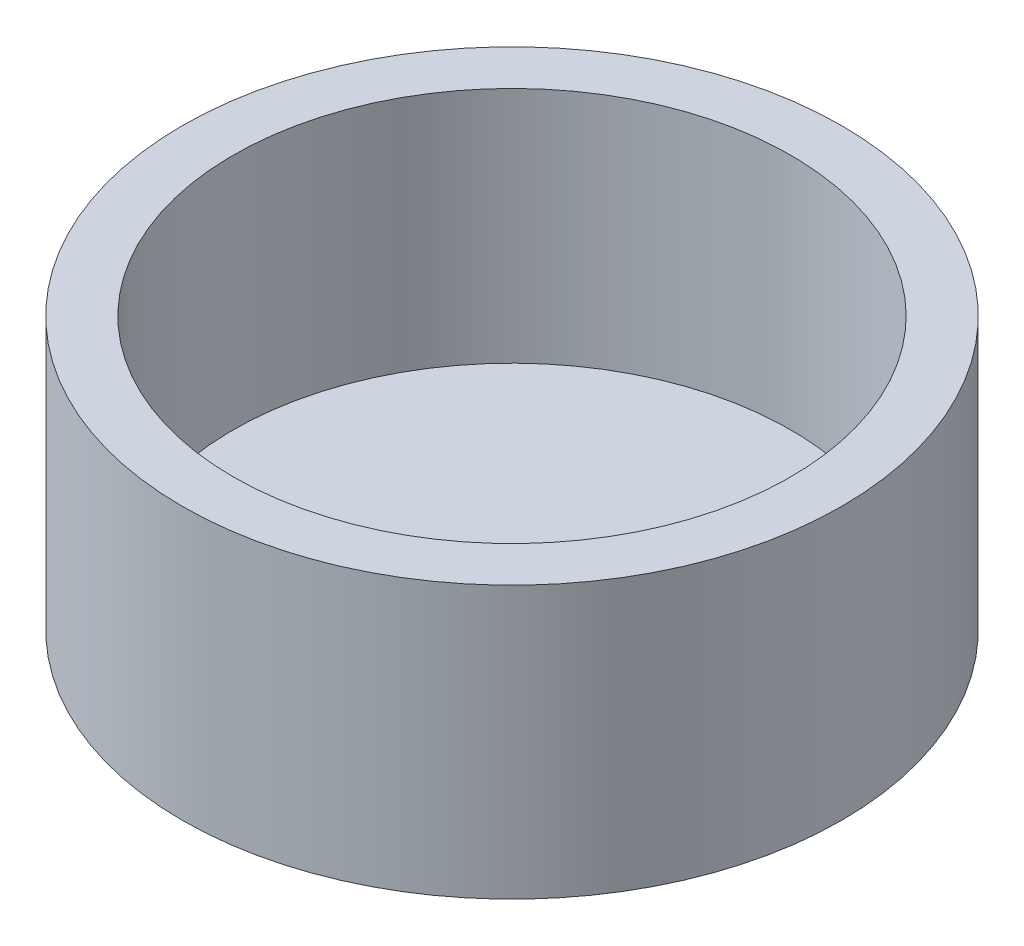
ISO-10303-21;
HEADER;
FILE_DESCRIPTION(('STEP AP214'),'2;1');
FILE_NAME('part.step','',(''),(''),'','','');
FILE_SCHEMA(('AUTOMOTIVE_DESIGN { 1 0 10303 214 1 1 1 1 }'));
ENDSEC;
DATA;
#1=APPLICATION_CONTEXT('core data for automotive mechanical design processes');
#2=APPLICATION_PROTOCOL_DEFINITION('international standard','automotive_design',2000,#1);
#3=PRODUCT_CONTEXT('',#1,'mechanical');
#4=PRODUCT('Part','Part','',(#3));
#5=PRODUCT_RELATED_PRODUCT_CATEGORY('part','',(#4));
#6=PRODUCT_DEFINITION_FORMATION('','',#4);
#7=PRODUCT_DEFINITION_CONTEXT('part definition',#1,'design');
#8=PRODUCT_DEFINITION('design','',#6,#7);
#9=PRODUCT_DEFINITION_SHAPE('','',#8);
#10=(LENGTH_UNIT() NAMED_UNIT(*) SI_UNIT(.MILLI.,.METRE.));
#11=(NAMED_UNIT(*) PLANE_ANGLE_UNIT() SI_UNIT($,.RADIAN.));
#12=(NAMED_UNIT(*) SI_UNIT($,.STERADIAN.) SOLID_ANGLE_UNIT());
#13=UNCERTAINTY_MEASURE_WITH_UNIT(LENGTH_MEASURE(1.E-05),#10,'distance_accuracy_value','');
#14=(GEOMETRIC_REPRESENTATION_CONTEXT(3) GLOBAL_UNCERTAINTY_ASSIGNED_CONTEXT((#13)) GLOBAL_UNIT_ASSIGNED_CONTEXT((#10,
#11,#12)) REPRESENTATION_CONTEXT('',''));
#15=CARTESIAN_POINT('',(0.,0.,0.));
#16=DIRECTION('',(0.,0.,1.));
#17=DIRECTION('',(1.,0.,0.));
#18=AXIS2_PLACEMENT_3D('',#15,#16,#17);
#19=CARTESIAN_POINT('',(0.,4.,0.));
#20=DIRECTION('',(0.,-1.,0.));
#21=DIRECTION('',(0.,0.,-1.));
#22=AXIS2_PLACEMENT_3D('',#19,#20,#21);
#23=CYLINDRICAL_SURFACE('',#22,4.85);
#24=CARTESIAN_POINT('',(0.,4.,0.));
#25=DIRECTION('',(0.,1.,0.));
#26=DIRECTION('',(0.,0.,1.));
#27=AXIS2_PLACEMENT_3D('',#24,#25,#26);
#28=CIRCLE('',#27,4.85);
#29=CARTESIAN_POINT('',(0.,4.,4.85));
#30=VERTEX_POINT('',#29);
#31=EDGE_CURVE('E10',#30,#30,#28,.T.);
#32=ORIENTED_EDGE('',*,*,#31,.F.);
#33=EDGE_LOOP('',(#32));
#34=FACE_BOUND('',#33,.T.);
#35=CARTESIAN_POINT('',(0.,0.,0.));
#36=DIRECTION('',(0.,1.,0.));
#37=DIRECTION('',(0.,0.,1.));
#38=AXIS2_PLACEMENT_3D('',#35,#36,#37);
#39=CIRCLE('',#38,4.85);
#40=CARTESIAN_POINT('',(0.,0.,4.85));
#41=VERTEX_POINT('',#40);
#42=EDGE_CURVE('E40',#41,#41,#39,.T.);
#43=ORIENTED_EDGE('',*,*,#42,.T.);
#44=EDGE_LOOP('',(#43));
#45=FACE_BOUND('',#44,.T.);
#46=ADVANCED_FACE('F37',(#34,#45),#23,.T.);
#47=CARTESIAN_POINT('',(0.,4.,0.));
#48=DIRECTION('',(0.,1.,0.));
#49=DIRECTION('',(0.,0.,1.));
#50=AXIS2_PLACEMENT_3D('',#47,#48,#49);
#51=PLANE('',#50);
#52=CARTESIAN_POINT('',(0.,4.,0.));
#53=DIRECTION('',(0.,1.,0.));
#54=DIRECTION('',(0.,0.,1.));
#55=AXIS2_PLACEMENT_3D('',#52,#53,#54);
#56=CIRCLE('',#55,4.1);
#57=CARTESIAN_POINT('',(0.,4.,4.1));
#58=VERTEX_POINT('',#57);
#59=EDGE_CURVE('E51',#58,#58,#56,.T.);
#60=ORIENTED_EDGE('',*,*,#59,.F.);
#61=EDGE_LOOP('',(#60));
#62=FACE_BOUND('',#61,.T.);
#63=ORIENTED_EDGE('',*,*,#31,.T.);
#64=EDGE_LOOP('',(#63));
#65=FACE_BOUND('',#64,.T.);
#66=ADVANCED_FACE('F68',(#62,#65),#51,.T.);
#67=CARTESIAN_POINT('',(0.,0.,0.));
#68=DIRECTION('',(0.,1.,0.));
#69=DIRECTION('',(0.,0.,1.));
#70=AXIS2_PLACEMENT_3D('',#67,#68,#69);
#71=PLANE('',#70);
#72=ORIENTED_EDGE('',*,*,#42,.F.);
#73=EDGE_LOOP('',(#72));
#74=FACE_BOUND('',#73,.T.);
#75=ADVANCED_FACE('F64',(#74),#71,.F.);
#76=CARTESIAN_POINT('',(0.,0.5,0.));
#77=DIRECTION('',(0.,1.,0.));
#78=DIRECTION('',(0.,0.,1.));
#79=AXIS2_PLACEMENT_3D('',#76,#77,#78);
#80=CYLINDRICAL_SURFACE('',#79,4.1);
#81=CARTESIAN_POINT('',(0.,0.5,0.));
#82=DIRECTION('',(0.,1.,0.));
#83=DIRECTION('',(0.,0.,1.));
#84=AXIS2_PLACEMENT_3D('',#81,#82,#83);
#85=CIRCLE('',#84,4.1);
#86=CARTESIAN_POINT('',(0.,0.5,4.1));
#87=VERTEX_POINT('',#86);
#88=EDGE_CURVE('E49',#87,#87,#85,.T.);
#89=ORIENTED_EDGE('',*,*,#88,.F.);
#90=EDGE_LOOP('',(#89));
#91=FACE_BOUND('',#90,.T.);
#92=ORIENTED_EDGE('',*,*,#59,.T.);
#93=EDGE_LOOP('',(#92));
#94=FACE_BOUND('',#93,.T.);
#95=ADVANCED_FACE('F61',(#91,#94),#80,.F.);
#96=CARTESIAN_POINT('',(0.,0.5,0.));
#97=DIRECTION('',(0.,1.,0.));
#98=DIRECTION('',(0.,0.,1.));
#99=AXIS2_PLACEMENT_3D('',#96,#97,#98);
#100=PLANE('',#99);
#101=ORIENTED_EDGE('',*,*,#88,.T.);
#102=EDGE_LOOP('',(#101));
#103=FACE_BOUND('',#102,.T.);
#104=ADVANCED_FACE('F59',(#103),#100,.T.);
#105=CLOSED_SHELL('',(#46,#66,#75,#95,#104));
#106=MANIFOLD_SOLID_BREP('B2',#105);
#107=ADVANCED_BREP_SHAPE_REPRESENTATION('',(#18,#106),#14);
#108=SHAPE_DEFINITION_REPRESENTATION(#9,#107);
ENDSEC;
END-ISO-10303-21;
